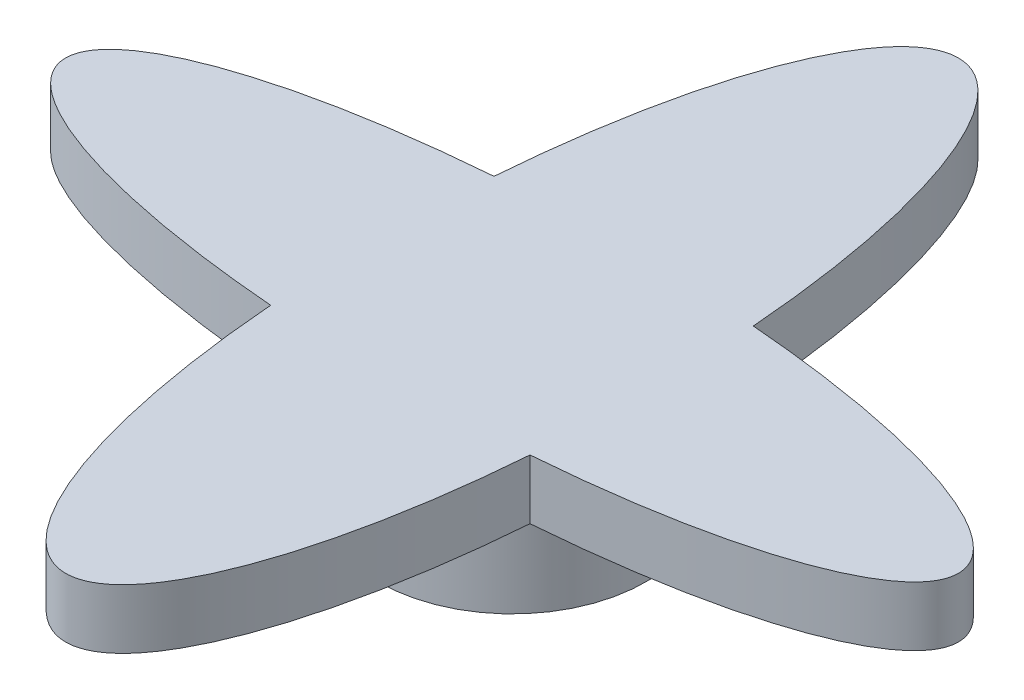
ISO-10303-21;
HEADER;
FILE_DESCRIPTION(('STEP AP214'),'2;1');
FILE_NAME('part.step','',(''),(''),'','','');
FILE_SCHEMA(('AUTOMOTIVE_DESIGN { 1 0 10303 214 1 1 1 1 }'));
ENDSEC;
DATA;
#1=APPLICATION_CONTEXT('core data for automotive mechanical design processes');
#2=APPLICATION_PROTOCOL_DEFINITION('international standard','automotive_design',2000,#1);
#3=PRODUCT_CONTEXT('',#1,'mechanical');
#4=PRODUCT('Part','Part','',(#3));
#5=PRODUCT_RELATED_PRODUCT_CATEGORY('part','',(#4));
#6=PRODUCT_DEFINITION_FORMATION('','',#4);
#7=PRODUCT_DEFINITION_CONTEXT('part definition',#1,'design');
#8=PRODUCT_DEFINITION('design','',#6,#7);
#9=PRODUCT_DEFINITION_SHAPE('','',#8);
#10=(LENGTH_UNIT() NAMED_UNIT(*) SI_UNIT(.MILLI.,.METRE.));
#11=(NAMED_UNIT(*) PLANE_ANGLE_UNIT() SI_UNIT($,.RADIAN.));
#12=(NAMED_UNIT(*) SI_UNIT($,.STERADIAN.) SOLID_ANGLE_UNIT());
#13=UNCERTAINTY_MEASURE_WITH_UNIT(LENGTH_MEASURE(1.E-05),#10,'distance_accuracy_value','');
#14=(GEOMETRIC_REPRESENTATION_CONTEXT(3) GLOBAL_UNCERTAINTY_ASSIGNED_CONTEXT((#13)) GLOBAL_UNIT_ASSIGNED_CONTEXT((#10,
#11,#12)) REPRESENTATION_CONTEXT('',''));
#15=CARTESIAN_POINT('',(0.,0.,0.));
#16=DIRECTION('',(0.,0.,1.));
#17=DIRECTION('',(1.,0.,0.));
#18=AXIS2_PLACEMENT_3D('',#15,#16,#17);
#19=CARTESIAN_POINT('',(0.,3.5,0.));
#20=DIRECTION('',(0.,-1.,0.));
#21=DIRECTION('',(0.,0.,-1.));
#22=AXIS2_PLACEMENT_3D('',#19,#20,#21);
#23=CYLINDRICAL_SURFACE('',#22,4.5);
#24=CARTESIAN_POINT('',(0.,3.5,0.));
#25=DIRECTION('',(0.,1.,0.));
#26=DIRECTION('',(0.,0.,1.));
#27=AXIS2_PLACEMENT_3D('',#24,#25,#26);
#28=CIRCLE('',#27,4.5);
#29=CARTESIAN_POINT('',(0.,3.5,4.5));
#30=VERTEX_POINT('',#29);
#31=EDGE_CURVE('E11',#30,#30,#28,.T.);
#32=ORIENTED_EDGE('',*,*,#31,.F.);
#33=EDGE_LOOP('',(#32));
#34=FACE_BOUND('',#33,.T.);
#35=CARTESIAN_POINT('',(0.,0.,0.));
#36=DIRECTION('',(0.,1.,0.));
#37=DIRECTION('',(0.,0.,1.));
#38=AXIS2_PLACEMENT_3D('',#35,#36,#37);
#39=CIRCLE('',#38,4.5);
#40=CARTESIAN_POINT('',(0.,0.,4.5));
#41=VERTEX_POINT('',#40);
#42=EDGE_CURVE('E35',#41,#41,#39,.T.);
#43=ORIENTED_EDGE('',*,*,#42,.T.);
#44=EDGE_LOOP('',(#43));
#45=FACE_BOUND('',#44,.T.);
#46=ADVANCED_FACE('F32',(#34,#45),#23,.T.);
#47=CARTESIAN_POINT('',(0.,0.,0.));
#48=DIRECTION('',(0.,1.,0.));
#49=DIRECTION('',(0.,0.,1.));
#50=AXIS2_PLACEMENT_3D('',#47,#48,#49);
#51=PLANE('',#50);
#52=ORIENTED_EDGE('',*,*,#42,.F.);
#53=EDGE_LOOP('',(#52));
#54=FACE_BOUND('',#53,.T.);
#55=ADVANCED_FACE('F112',(#54),#51,.F.);
#56=CARTESIAN_POINT('',(0.,5.5,0.));
#57=DIRECTION('',(0.,1.,0.));
#58=DIRECTION('',(-1.,0.,0.));
#59=AXIS2_PLACEMENT_3D('',#56,#57,#58);
#60=ELLIPSE('',#59,15.,3.92135168148322);
#61=DIRECTION('',(0.,-1.,0.));
#62=VECTOR('',#61,1.);
#63=SURFACE_OF_LINEAR_EXTRUSION('',#60,#62);
#64=CARTESIAN_POINT('',(0.,3.5,0.));
#65=DIRECTION('',(0.,1.,0.));
#66=DIRECTION('',(-1.,0.,0.));
#67=AXIS2_PLACEMENT_3D('',#64,#65,#66);
#68=ELLIPSE('',#67,15.,3.92135168148322);
#69=CARTESIAN_POINT('',(4.35692892647214,3.5,3.75228867888258));
#70=VERTEX_POINT('',#69);
#71=CARTESIAN_POINT('',(4.35692892647214,3.5,-3.75228867888257));
#72=VERTEX_POINT('',#71);
#73=EDGE_CURVE('E139',#70,#72,#68,.T.);
#74=ORIENTED_EDGE('',*,*,#73,.T.);
#75=DIRECTION('',(0.,-1.,0.));
#76=VECTOR('',#75,1.);
#77=CARTESIAN_POINT('',(4.35692892647214,5.5,-3.75228867888257));
#78=LINE('',#77,#76);
#79=CARTESIAN_POINT('',(4.35692892647214,5.5,-3.75228867888257));
#80=VERTEX_POINT('',#79);
#81=EDGE_CURVE('E90',#80,#72,#78,.T.);
#82=ORIENTED_EDGE('',*,*,#81,.F.);
#83=CARTESIAN_POINT('',(4.35692892647214,5.5,3.75228867888258));
#84=VERTEX_POINT('',#83);
#85=EDGE_CURVE('E84',#84,#80,#60,.T.);
#86=ORIENTED_EDGE('',*,*,#85,.F.);
#87=DIRECTION('',(0.,-1.,0.));
#88=VECTOR('',#87,1.);
#89=CARTESIAN_POINT('',(4.35692892647214,5.5,3.75228867888258));
#90=LINE('',#89,#88);
#91=EDGE_CURVE('E95',#84,#70,#90,.T.);
#92=ORIENTED_EDGE('',*,*,#91,.T.);
#93=EDGE_LOOP('',(#74,#82,#86,#92));
#94=FACE_BOUND('',#93,.T.);
#95=ADVANCED_FACE('F110',(#94),#63,.F.);
#96=CARTESIAN_POINT('',(0.,5.5,0.));
#97=DIRECTION('',(0.,1.,0.));
#98=DIRECTION('',(0.,0.,-1.));
#99=AXIS2_PLACEMENT_3D('',#96,#97,#98);
#100=ELLIPSE('',#99,15.,4.5);
#101=DIRECTION('',(0.,-1.,0.));
#102=VECTOR('',#101,1.);
#103=SURFACE_OF_LINEAR_EXTRUSION('',#100,#102);
#104=CARTESIAN_POINT('',(0.,3.5,0.));
#105=DIRECTION('',(0.,1.,0.));
#106=DIRECTION('',(0.,0.,-1.));
#107=AXIS2_PLACEMENT_3D('',#104,#105,#106);
#108=ELLIPSE('',#107,15.,4.5);
#109=CARTESIAN_POINT('',(-4.35692892647214,3.5,-3.75228867888258));
#110=VERTEX_POINT('',#109);
#111=EDGE_CURVE('E89',#72,#110,#108,.T.);
#112=ORIENTED_EDGE('',*,*,#111,.T.);
#113=DIRECTION('',(0.,-1.,0.));
#114=VECTOR('',#113,1.);
#115=CARTESIAN_POINT('',(-4.35692892647214,5.5,-3.75228867888258));
#116=LINE('',#115,#114);
#117=CARTESIAN_POINT('',(-4.35692892647214,5.5,-3.75228867888258));
#118=VERTEX_POINT('',#117);
#119=EDGE_CURVE('E87',#118,#110,#116,.T.);
#120=ORIENTED_EDGE('',*,*,#119,.F.);
#121=EDGE_CURVE('E79',#80,#118,#100,.T.);
#122=ORIENTED_EDGE('',*,*,#121,.F.);
#123=ORIENTED_EDGE('',*,*,#81,.T.);
#124=EDGE_LOOP('',(#112,#120,#122,#123));
#125=FACE_BOUND('',#124,.T.);
#126=ADVANCED_FACE('F88',(#125),#103,.F.);
#127=CARTESIAN_POINT('',(0.,5.5,0.));
#128=DIRECTION('',(0.,1.,0.));
#129=DIRECTION('',(-1.,0.,0.));
#130=AXIS2_PLACEMENT_3D('',#127,#128,#129);
#131=ELLIPSE('',#130,15.,3.92135168148322);
#132=DIRECTION('',(0.,-1.,0.));
#133=VECTOR('',#132,1.);
#134=SURFACE_OF_LINEAR_EXTRUSION('',#131,#133);
#135=CARTESIAN_POINT('',(0.,3.5,0.));
#136=DIRECTION('',(0.,1.,0.));
#137=DIRECTION('',(-1.,0.,0.));
#138=AXIS2_PLACEMENT_3D('',#135,#136,#137);
#139=ELLIPSE('',#138,15.,3.92135168148322);
#140=CARTESIAN_POINT('',(-4.35692892647215,3.5,3.75228867888257));
#141=VERTEX_POINT('',#140);
#142=EDGE_CURVE('E65',#110,#141,#139,.T.);
#143=ORIENTED_EDGE('',*,*,#142,.T.);
#144=DIRECTION('',(0.,-1.,0.));
#145=VECTOR('',#144,1.);
#146=CARTESIAN_POINT('',(-4.35692892647215,5.5,3.75228867888257));
#147=LINE('',#146,#145);
#148=CARTESIAN_POINT('',(-4.35692892647215,5.5,3.75228867888257));
#149=VERTEX_POINT('',#148);
#150=EDGE_CURVE('E91',#149,#141,#147,.T.);
#151=ORIENTED_EDGE('',*,*,#150,.F.);
#152=EDGE_CURVE('E82',#118,#149,#131,.T.);
#153=ORIENTED_EDGE('',*,*,#152,.F.);
#154=ORIENTED_EDGE('',*,*,#119,.T.);
#155=EDGE_LOOP('',(#143,#151,#153,#154));
#156=FACE_BOUND('',#155,.T.);
#157=ADVANCED_FACE('F93',(#156),#134,.F.);
#158=CARTESIAN_POINT('',(0.,5.5,0.));
#159=DIRECTION('',(0.,1.,0.));
#160=DIRECTION('',(0.,0.,-1.));
#161=AXIS2_PLACEMENT_3D('',#158,#159,#160);
#162=ELLIPSE('',#161,15.,4.5);
#163=DIRECTION('',(0.,-1.,0.));
#164=VECTOR('',#163,1.);
#165=SURFACE_OF_LINEAR_EXTRUSION('',#162,#164);
#166=CARTESIAN_POINT('',(0.,3.5,0.));
#167=DIRECTION('',(0.,1.,0.));
#168=DIRECTION('',(0.,0.,-1.));
#169=AXIS2_PLACEMENT_3D('',#166,#167,#168);
#170=ELLIPSE('',#169,15.,4.5);
#171=EDGE_CURVE('E71',#141,#70,#170,.T.);
#172=ORIENTED_EDGE('',*,*,#171,.T.);
#173=ORIENTED_EDGE('',*,*,#91,.F.);
#174=EDGE_CURVE('E48',#149,#84,#162,.T.);
#175=ORIENTED_EDGE('',*,*,#174,.F.);
#176=ORIENTED_EDGE('',*,*,#150,.T.);
#177=EDGE_LOOP('',(#172,#173,#175,#176));
#178=FACE_BOUND('',#177,.T.);
#179=ADVANCED_FACE('F106',(#178),#165,.F.);
#180=CARTESIAN_POINT('',(0.,5.5,0.));
#181=DIRECTION('',(0.,1.,0.));
#182=DIRECTION('',(0.,0.,1.));
#183=AXIS2_PLACEMENT_3D('',#180,#181,#182);
#184=PLANE('',#183);
#185=ORIENTED_EDGE('',*,*,#85,.T.);
#186=ORIENTED_EDGE('',*,*,#121,.T.);
#187=ORIENTED_EDGE('',*,*,#152,.T.);
#188=ORIENTED_EDGE('',*,*,#174,.T.);
#189=EDGE_LOOP('',(#185,#186,#187,#188));
#190=FACE_BOUND('',#189,.T.);
#191=ADVANCED_FACE('F80',(#190),#184,.T.);
#192=CARTESIAN_POINT('',(0.,3.5,0.));
#193=DIRECTION('',(0.,1.,0.));
#194=DIRECTION('',(0.,0.,1.));
#195=AXIS2_PLACEMENT_3D('',#192,#193,#194);
#196=PLANE('',#195);
#197=ORIENTED_EDGE('',*,*,#31,.T.);
#198=EDGE_LOOP('',(#197));
#199=FACE_BOUND('',#198,.T.);
#200=ORIENTED_EDGE('',*,*,#73,.F.);
#201=ORIENTED_EDGE('',*,*,#171,.F.);
#202=ORIENTED_EDGE('',*,*,#142,.F.);
#203=ORIENTED_EDGE('',*,*,#111,.F.);
#204=EDGE_LOOP('',(#200,#201,#202,#203));
#205=FACE_BOUND('',#204,.T.);
#206=ADVANCED_FACE('F135',(#199,#205),#196,.F.);
#207=CLOSED_SHELL('',(#46,#55,#95,#126,#157,#179,#191,#206));
#208=MANIFOLD_SOLID_BREP('B2',#207);
#209=ADVANCED_BREP_SHAPE_REPRESENTATION('',(#18,#208),#14);
#210=SHAPE_DEFINITION_REPRESENTATION(#9,#209);
ENDSEC;
END-ISO-10303-21;
